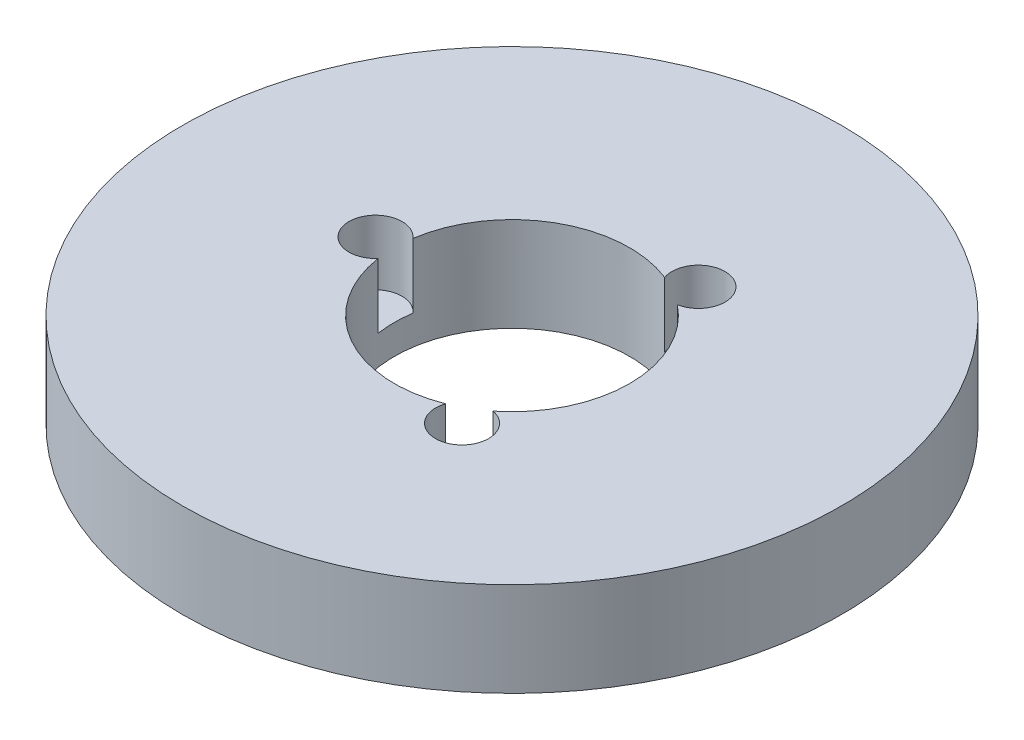
ISO-10303-21;
HEADER;
FILE_DESCRIPTION(('STEP AP214'),'2;1');
FILE_NAME('part.step','',(''),(''),'','','');
FILE_SCHEMA(('AUTOMOTIVE_DESIGN { 1 0 10303 214 1 1 1 1 }'));
ENDSEC;
DATA;
#1=APPLICATION_CONTEXT('core data for automotive mechanical design processes');
#2=APPLICATION_PROTOCOL_DEFINITION('international standard','automotive_design',2000,#1);
#3=PRODUCT_CONTEXT('',#1,'mechanical');
#4=PRODUCT('Part','Part','',(#3));
#5=PRODUCT_RELATED_PRODUCT_CATEGORY('part','',(#4));
#6=PRODUCT_DEFINITION_FORMATION('','',#4);
#7=PRODUCT_DEFINITION_CONTEXT('part definition',#1,'design');
#8=PRODUCT_DEFINITION('design','',#6,#7);
#9=PRODUCT_DEFINITION_SHAPE('','',#8);
#10=(LENGTH_UNIT() NAMED_UNIT(*) SI_UNIT(.MILLI.,.METRE.));
#11=(NAMED_UNIT(*) PLANE_ANGLE_UNIT() SI_UNIT($,.RADIAN.));
#12=(NAMED_UNIT(*) SI_UNIT($,.STERADIAN.) SOLID_ANGLE_UNIT());
#13=UNCERTAINTY_MEASURE_WITH_UNIT(LENGTH_MEASURE(1.E-05),#10,'distance_accuracy_value','');
#14=(GEOMETRIC_REPRESENTATION_CONTEXT(3) GLOBAL_UNCERTAINTY_ASSIGNED_CONTEXT((#13)) GLOBAL_UNIT_ASSIGNED_CONTEXT((#10,
#11,#12)) REPRESENTATION_CONTEXT('',''));
#15=CARTESIAN_POINT('',(0.,0.,0.));
#16=DIRECTION('',(0.,0.,1.));
#17=DIRECTION('',(1.,0.,0.));
#18=AXIS2_PLACEMENT_3D('',#15,#16,#17);
#19=CARTESIAN_POINT('',(0.,10.,0.));
#20=DIRECTION('',(0.,-1.,0.));
#21=DIRECTION('',(0.,0.,-1.));
#22=AXIS2_PLACEMENT_3D('',#19,#20,#21);
#23=CYLINDRICAL_SURFACE('',#22,35.);
#24=CARTESIAN_POINT('',(0.,10.,0.));
#25=DIRECTION('',(0.,1.,0.));
#26=DIRECTION('',(0.,0.,1.));
#27=AXIS2_PLACEMENT_3D('',#24,#25,#26);
#28=CIRCLE('',#27,35.);
#29=CARTESIAN_POINT('',(0.,10.,35.));
#30=VERTEX_POINT('',#29);
#31=EDGE_CURVE('E126',#30,#30,#28,.T.);
#32=ORIENTED_EDGE('',*,*,#31,.F.);
#33=EDGE_LOOP('',(#32));
#34=FACE_BOUND('',#33,.T.);
#35=CARTESIAN_POINT('',(0.,0.,0.));
#36=DIRECTION('',(0.,1.,0.));
#37=DIRECTION('',(0.,0.,1.));
#38=AXIS2_PLACEMENT_3D('',#35,#36,#37);
#39=CIRCLE('',#38,35.);
#40=CARTESIAN_POINT('',(0.,0.,35.));
#41=VERTEX_POINT('',#40);
#42=EDGE_CURVE('E124',#41,#41,#39,.T.);
#43=ORIENTED_EDGE('',*,*,#42,.T.);
#44=EDGE_LOOP('',(#43));
#45=FACE_BOUND('',#44,.T.);
#46=ADVANCED_FACE('F39',(#34,#45),#23,.T.);
#47=CARTESIAN_POINT('',(0.,10.,0.));
#48=DIRECTION('',(0.,1.,0.));
#49=DIRECTION('',(0.,0.,1.));
#50=AXIS2_PLACEMENT_3D('',#47,#48,#49);
#51=PLANE('',#50);
#52=CARTESIAN_POINT('',(7.24891075164513,10.,12.5554817213815));
#53=DIRECTION('',(0.,1.,0.));
#54=DIRECTION('',(0.866025403784436,0.,-0.500000000000004));
#55=AXIS2_PLACEMENT_3D('',#52,#53,#54);
#56=CIRCLE('',#55,2.81932506451268);
#57=CARTESIAN_POINT('',(4.58644986732128,10.,11.6281760226851));
#58=VERTEX_POINT('',#57);
#59=CARTESIAN_POINT('',(7.77707090166184,10.,9.78607010962647));
#60=VERTEX_POINT('',#59);
#61=EDGE_CURVE('E147',#58,#60,#56,.T.);
#62=ORIENTED_EDGE('',*,*,#61,.F.);
#63=CARTESIAN_POINT('',(0.,10.,0.));
#64=DIRECTION('',(0.,1.,0.));
#65=DIRECTION('',(0.,0.,1.));
#66=AXIS2_PLACEMENT_3D('',#63,#64,#65);
#67=CIRCLE('',#66,12.5);
#68=CARTESIAN_POINT('',(-12.363520768983,10.,1.84210591305861));
#69=VERTEX_POINT('',#68);
#70=EDGE_CURVE('E118',#69,#58,#67,.T.);
#71=ORIENTED_EDGE('',*,*,#70,.F.);
#72=CARTESIAN_POINT('',(-14.4978215032901,10.,0.));
#73=DIRECTION('',(0.,1.,0.));
#74=DIRECTION('',(0.,0.,1.));
#75=AXIS2_PLACEMENT_3D('',#72,#73,#74);
#76=CIRCLE('',#75,2.81932506451268);
#77=CARTESIAN_POINT('',(-12.363520768983,10.,-1.84210591305861));
#78=VERTEX_POINT('',#77);
#79=EDGE_CURVE('E113',#78,#69,#76,.T.);
#80=ORIENTED_EDGE('',*,*,#79,.F.);
#81=CARTESIAN_POINT('',(4.58644986732112,10.,-11.6281760226852));
#82=VERTEX_POINT('',#81);
#83=EDGE_CURVE('E106',#82,#78,#67,.T.);
#84=ORIENTED_EDGE('',*,*,#83,.F.);
#85=CARTESIAN_POINT('',(7.24891075164496,10.,-12.5554817213816));
#86=DIRECTION('',(0.,1.,0.));
#87=DIRECTION('',(-0.866025403784443,0.,-0.499999999999992));
#88=AXIS2_PLACEMENT_3D('',#85,#86,#87);
#89=CIRCLE('',#88,2.81932506451268);
#90=CARTESIAN_POINT('',(7.77707090166171,10.,-9.78607010962658));
#91=VERTEX_POINT('',#90);
#92=EDGE_CURVE('E90',#91,#82,#89,.T.);
#93=ORIENTED_EDGE('',*,*,#92,.F.);
#94=EDGE_CURVE('E116',#60,#91,#67,.T.);
#95=ORIENTED_EDGE('',*,*,#94,.F.);
#96=EDGE_LOOP('',(#62,#71,#80,#84,#93,#95));
#97=FACE_BOUND('',#96,.T.);
#98=ORIENTED_EDGE('',*,*,#31,.T.);
#99=EDGE_LOOP('',(#98));
#100=FACE_BOUND('',#99,.T.);
#101=ADVANCED_FACE('F115',(#97,#100),#51,.T.);
#102=CARTESIAN_POINT('',(0.,0.,0.));
#103=DIRECTION('',(0.,1.,0.));
#104=DIRECTION('',(0.,0.,1.));
#105=AXIS2_PLACEMENT_3D('',#102,#103,#104);
#106=PLANE('',#105);
#107=CARTESIAN_POINT('',(0.,0.,0.));
#108=DIRECTION('',(0.,1.,0.));
#109=DIRECTION('',(0.,0.,1.));
#110=AXIS2_PLACEMENT_3D('',#107,#108,#109);
#111=CIRCLE('',#110,12.5);
#112=CARTESIAN_POINT('',(0.,0.,12.5));
#113=VERTEX_POINT('',#112);
#114=EDGE_CURVE('E120',#113,#113,#111,.T.);
#115=ORIENTED_EDGE('',*,*,#114,.T.);
#116=EDGE_LOOP('',(#115));
#117=FACE_BOUND('',#116,.T.);
#118=ORIENTED_EDGE('',*,*,#42,.F.);
#119=EDGE_LOOP('',(#118));
#120=FACE_BOUND('',#119,.T.);
#121=ADVANCED_FACE('F164',(#117,#120),#106,.F.);
#122=CARTESIAN_POINT('',(0.,10.,0.));
#123=DIRECTION('',(0.,-1.,0.));
#124=DIRECTION('',(0.,0.,-1.));
#125=AXIS2_PLACEMENT_3D('',#122,#123,#124);
#126=CYLINDRICAL_SURFACE('',#125,12.5);
#127=DIRECTION('',(0.,1.,0.));
#128=VECTOR('',#127,1.);
#129=CARTESIAN_POINT('',(4.58644986732128,6.56454339470951,11.6281760226851));
#130=LINE('',#129,#128);
#131=CARTESIAN_POINT('',(4.58644986732128,3.12908678941903,11.6281760226851));
#132=VERTEX_POINT('',#131);
#133=EDGE_CURVE('E11',#132,#58,#130,.T.);
#134=ORIENTED_EDGE('',*,*,#133,.F.);
#135=CARTESIAN_POINT('',(0.,3.12908678941903,0.));
#136=DIRECTION('',(0.,1.,0.));
#137=DIRECTION('',(0.,0.,1.));
#138=AXIS2_PLACEMENT_3D('',#135,#136,#137);
#139=CIRCLE('',#138,12.5);
#140=CARTESIAN_POINT('',(7.77707090166184,3.12908678941903,9.78607010962647));
#141=VERTEX_POINT('',#140);
#142=EDGE_CURVE('E144',#132,#141,#139,.T.);
#143=ORIENTED_EDGE('',*,*,#142,.T.);
#144=DIRECTION('',(0.,1.,0.));
#145=VECTOR('',#144,1.);
#146=CARTESIAN_POINT('',(7.77707090166185,6.56454339470951,9.78607010962647));
#147=LINE('',#146,#145);
#148=EDGE_CURVE('E46',#60,#141,#147,.F.);
#149=ORIENTED_EDGE('',*,*,#148,.F.);
#150=ORIENTED_EDGE('',*,*,#94,.T.);
#151=DIRECTION('',(0.,1.,0.));
#152=VECTOR('',#151,1.);
#153=CARTESIAN_POINT('',(7.77707090166171,6.56454339470951,-9.78607010962658));
#154=LINE('',#153,#152);
#155=CARTESIAN_POINT('',(7.77707090166171,3.12908678941903,-9.78607010962658));
#156=VERTEX_POINT('',#155);
#157=EDGE_CURVE('E92',#156,#91,#154,.T.);
#158=ORIENTED_EDGE('',*,*,#157,.F.);
#159=CARTESIAN_POINT('',(0.,3.12908678941903,0.));
#160=DIRECTION('',(0.,1.,0.));
#161=DIRECTION('',(0.,0.,1.));
#162=AXIS2_PLACEMENT_3D('',#159,#160,#161);
#163=CIRCLE('',#162,12.5);
#164=CARTESIAN_POINT('',(4.58644986732112,3.12908678941903,-11.6281760226852));
#165=VERTEX_POINT('',#164);
#166=EDGE_CURVE('E107',#156,#165,#163,.T.);
#167=ORIENTED_EDGE('',*,*,#166,.T.);
#168=DIRECTION('',(0.,1.,0.));
#169=VECTOR('',#168,1.);
#170=CARTESIAN_POINT('',(4.58644986732111,6.56454339470951,-11.6281760226852));
#171=LINE('',#170,#169);
#172=EDGE_CURVE('E95',#82,#165,#171,.F.);
#173=ORIENTED_EDGE('',*,*,#172,.F.);
#174=ORIENTED_EDGE('',*,*,#83,.T.);
#175=DIRECTION('',(0.,1.,0.));
#176=VECTOR('',#175,1.);
#177=CARTESIAN_POINT('',(-12.363520768983,6.56454339470951,-1.84210591305862));
#178=LINE('',#177,#176);
#179=CARTESIAN_POINT('',(-12.363520768983,3.12908678941903,-1.84210591305861));
#180=VERTEX_POINT('',#179);
#181=EDGE_CURVE('E143',#180,#78,#178,.T.);
#182=ORIENTED_EDGE('',*,*,#181,.F.);
#183=CARTESIAN_POINT('',(0.,3.12908678941903,0.));
#184=DIRECTION('',(0.,1.,0.));
#185=DIRECTION('',(0.,0.,1.));
#186=AXIS2_PLACEMENT_3D('',#183,#184,#185);
#187=CIRCLE('',#186,12.5);
#188=CARTESIAN_POINT('',(-12.363520768983,3.12908678941903,1.84210591305861));
#189=VERTEX_POINT('',#188);
#190=EDGE_CURVE('E132',#180,#189,#187,.T.);
#191=ORIENTED_EDGE('',*,*,#190,.T.);
#192=DIRECTION('',(0.,1.,0.));
#193=VECTOR('',#192,1.);
#194=CARTESIAN_POINT('',(-12.363520768983,6.56454339470951,1.84210591305862));
#195=LINE('',#194,#193);
#196=EDGE_CURVE('E137',#69,#189,#195,.F.);
#197=ORIENTED_EDGE('',*,*,#196,.F.);
#198=ORIENTED_EDGE('',*,*,#70,.T.);
#199=EDGE_LOOP('',(#134,#143,#149,#150,#158,#167,#173,#174,#182,#191,#197,#198));
#200=FACE_BOUND('',#199,.T.);
#201=ORIENTED_EDGE('',*,*,#114,.F.);
#202=EDGE_LOOP('',(#201));
#203=FACE_BOUND('',#202,.T.);
#204=ADVANCED_FACE('F103',(#200,#203),#126,.F.);
#205=CARTESIAN_POINT('',(-14.4978215032901,3.12908678941903,0.));
#206=DIRECTION('',(0.,1.,0.));
#207=DIRECTION('',(0.,0.,1.));
#208=AXIS2_PLACEMENT_3D('',#205,#206,#207);
#209=CYLINDRICAL_SURFACE('',#208,2.81932506451268);
#210=ORIENTED_EDGE('',*,*,#181,.T.);
#211=ORIENTED_EDGE('',*,*,#79,.T.);
#212=ORIENTED_EDGE('',*,*,#196,.T.);
#213=CARTESIAN_POINT('',(-14.4978215032901,3.12908678941903,0.));
#214=DIRECTION('',(0.,1.,0.));
#215=DIRECTION('',(0.,0.,1.));
#216=AXIS2_PLACEMENT_3D('',#213,#214,#215);
#217=CIRCLE('',#216,2.81932506451268);
#218=EDGE_CURVE('E121',#180,#189,#217,.T.);
#219=ORIENTED_EDGE('',*,*,#218,.F.);
#220=EDGE_LOOP('',(#210,#211,#212,#219));
#221=FACE_BOUND('',#220,.T.);
#222=ADVANCED_FACE('F174',(#221),#209,.F.);
#223=CARTESIAN_POINT('',(-14.4978215032901,3.12908678941903,0.));
#224=DIRECTION('',(0.,1.,0.));
#225=DIRECTION('',(0.,0.,1.));
#226=AXIS2_PLACEMENT_3D('',#223,#224,#225);
#227=PLANE('',#226);
#228=ORIENTED_EDGE('',*,*,#218,.T.);
#229=ORIENTED_EDGE('',*,*,#190,.F.);
#230=EDGE_LOOP('',(#228,#229));
#231=FACE_BOUND('',#230,.T.);
#232=ADVANCED_FACE('F177',(#231),#227,.T.);
#233=CARTESIAN_POINT('',(7.24891075164496,3.12908678941903,-12.5554817213816));
#234=DIRECTION('',(0.,1.,0.));
#235=DIRECTION('',(0.,0.,1.));
#236=AXIS2_PLACEMENT_3D('',#233,#234,#235);
#237=CYLINDRICAL_SURFACE('',#236,2.81932506451268);
#238=ORIENTED_EDGE('',*,*,#157,.T.);
#239=ORIENTED_EDGE('',*,*,#92,.T.);
#240=ORIENTED_EDGE('',*,*,#172,.T.);
#241=CARTESIAN_POINT('',(7.24891075164496,3.12908678941903,-12.5554817213816));
#242=DIRECTION('',(0.,1.,0.));
#243=DIRECTION('',(-0.866025403784443,0.,-0.499999999999992));
#244=AXIS2_PLACEMENT_3D('',#241,#242,#243);
#245=CIRCLE('',#244,2.81932506451268);
#246=EDGE_CURVE('E56',#156,#165,#245,.T.);
#247=ORIENTED_EDGE('',*,*,#246,.F.);
#248=EDGE_LOOP('',(#238,#239,#240,#247));
#249=FACE_BOUND('',#248,.T.);
#250=ADVANCED_FACE('F93',(#249),#237,.F.);
#251=CARTESIAN_POINT('',(7.24891075164496,3.12908678941903,-12.5554817213816));
#252=DIRECTION('',(0.,1.,0.));
#253=DIRECTION('',(-0.866025403784443,0.,-0.499999999999992));
#254=AXIS2_PLACEMENT_3D('',#251,#252,#253);
#255=PLANE('',#254);
#256=ORIENTED_EDGE('',*,*,#246,.T.);
#257=ORIENTED_EDGE('',*,*,#166,.F.);
#258=EDGE_LOOP('',(#256,#257));
#259=FACE_BOUND('',#258,.T.);
#260=ADVANCED_FACE('F160',(#259),#255,.T.);
#261=CARTESIAN_POINT('',(7.24891075164513,3.12908678941903,12.5554817213815));
#262=DIRECTION('',(0.,1.,0.));
#263=DIRECTION('',(0.,0.,1.));
#264=AXIS2_PLACEMENT_3D('',#261,#262,#263);
#265=CYLINDRICAL_SURFACE('',#264,2.81932506451268);
#266=ORIENTED_EDGE('',*,*,#133,.T.);
#267=ORIENTED_EDGE('',*,*,#61,.T.);
#268=ORIENTED_EDGE('',*,*,#148,.T.);
#269=CARTESIAN_POINT('',(7.24891075164513,3.12908678941903,12.5554817213815));
#270=DIRECTION('',(0.,1.,0.));
#271=DIRECTION('',(0.866025403784436,0.,-0.500000000000004));
#272=AXIS2_PLACEMENT_3D('',#269,#270,#271);
#273=CIRCLE('',#272,2.81932506451268);
#274=EDGE_CURVE('E55',#132,#141,#273,.T.);
#275=ORIENTED_EDGE('',*,*,#274,.F.);
#276=EDGE_LOOP('',(#266,#267,#268,#275));
#277=FACE_BOUND('',#276,.T.);
#278=ADVANCED_FACE('F149',(#277),#265,.F.);
#279=CARTESIAN_POINT('',(7.24891075164513,3.12908678941903,12.5554817213815));
#280=DIRECTION('',(0.,1.,0.));
#281=DIRECTION('',(0.866025403784436,0.,-0.500000000000004));
#282=AXIS2_PLACEMENT_3D('',#279,#280,#281);
#283=PLANE('',#282);
#284=ORIENTED_EDGE('',*,*,#274,.T.);
#285=ORIENTED_EDGE('',*,*,#142,.F.);
#286=EDGE_LOOP('',(#284,#285));
#287=FACE_BOUND('',#286,.T.);
#288=ADVANCED_FACE('F151',(#287),#283,.T.);
#289=CLOSED_SHELL('',(#46,#101,#121,#204,#222,#232,#250,#260,#278,#288));
#290=MANIFOLD_SOLID_BREP('B2',#289);
#291=ADVANCED_BREP_SHAPE_REPRESENTATION('',(#18,#290),#14);
#292=SHAPE_DEFINITION_REPRESENTATION(#9,#291);
ENDSEC;
END-ISO-10303-21;
